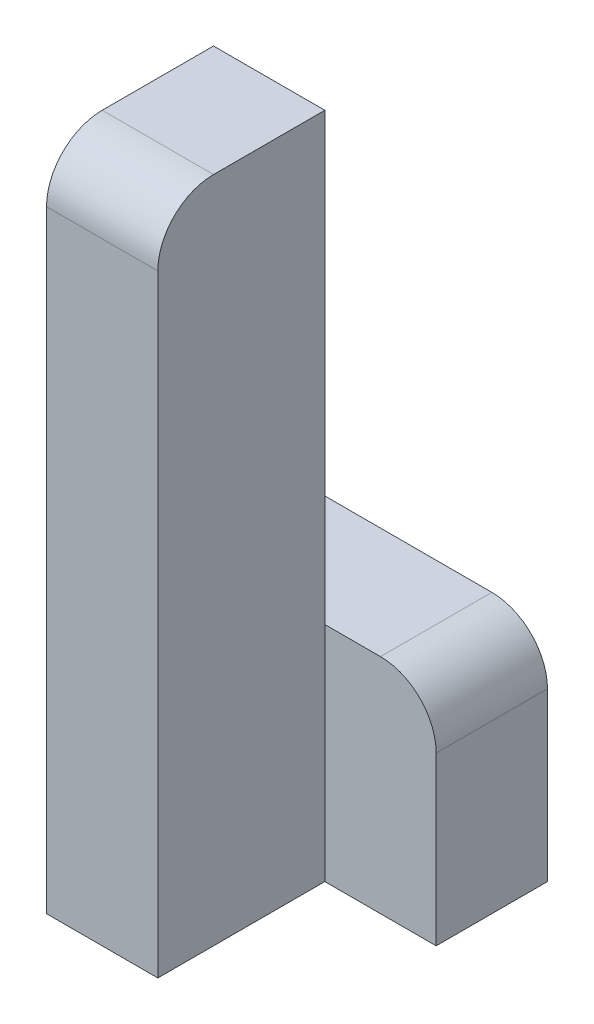
ISO-10303-21;
HEADER;
FILE_DESCRIPTION(('STEP AP214'),'2;1');
FILE_NAME('part.step','',(''),(''),'','','');
FILE_SCHEMA(('AUTOMOTIVE_DESIGN { 1 0 10303 214 1 1 1 1 }'));
ENDSEC;
DATA;
#1=APPLICATION_CONTEXT('core data for automotive mechanical design processes');
#2=APPLICATION_PROTOCOL_DEFINITION('international standard','automotive_design',2000,#1);
#3=PRODUCT_CONTEXT('',#1,'mechanical');
#4=PRODUCT('Part','Part','',(#3));
#5=PRODUCT_RELATED_PRODUCT_CATEGORY('part','',(#4));
#6=PRODUCT_DEFINITION_FORMATION('','',#4);
#7=PRODUCT_DEFINITION_CONTEXT('part definition',#1,'design');
#8=PRODUCT_DEFINITION('design','',#6,#7);
#9=PRODUCT_DEFINITION_SHAPE('','',#8);
#10=(LENGTH_UNIT() NAMED_UNIT(*) SI_UNIT(.MILLI.,.METRE.));
#11=(NAMED_UNIT(*) PLANE_ANGLE_UNIT() SI_UNIT($,.RADIAN.));
#12=(NAMED_UNIT(*) SI_UNIT($,.STERADIAN.) SOLID_ANGLE_UNIT());
#13=UNCERTAINTY_MEASURE_WITH_UNIT(LENGTH_MEASURE(1.E-05),#10,'distance_accuracy_value','');
#14=(GEOMETRIC_REPRESENTATION_CONTEXT(3) GLOBAL_UNCERTAINTY_ASSIGNED_CONTEXT((#13)) GLOBAL_UNIT_ASSIGNED_CONTEXT((#10,
#11,#12)) REPRESENTATION_CONTEXT('',''));
#15=CARTESIAN_POINT('',(0.,0.,0.));
#16=DIRECTION('',(0.,0.,1.));
#17=DIRECTION('',(1.,0.,0.));
#18=AXIS2_PLACEMENT_3D('',#15,#16,#17);
#19=CARTESIAN_POINT('',(-10.,0.,30.));
#20=DIRECTION('',(0.,-1.,0.));
#21=DIRECTION('',(1.,0.,0.));
#22=AXIS2_PLACEMENT_3D('',#19,#20,#21);
#23=PLANE('',#22);
#24=DIRECTION('',(0.,0.,-1.));
#25=VECTOR('',#24,1.);
#26=CARTESIAN_POINT('',(-30.,0.,30.));
#27=LINE('',#26,#25);
#28=CARTESIAN_POINT('',(-30.,0.,20.));
#29=VERTEX_POINT('',#28);
#30=CARTESIAN_POINT('',(-30.,0.,0.));
#31=VERTEX_POINT('',#30);
#32=EDGE_CURVE('E171',#29,#31,#27,.T.);
#33=ORIENTED_EDGE('',*,*,#32,.F.);
#34=DIRECTION('',(-1.,0.,0.));
#35=VECTOR('',#34,1.);
#36=CARTESIAN_POINT('',(-10.,0.,20.));
#37=LINE('',#36,#35);
#38=CARTESIAN_POINT('',(-10.,0.,20.));
#39=VERTEX_POINT('',#38);
#40=EDGE_CURVE('E43',#29,#39,#37,.F.);
#41=ORIENTED_EDGE('',*,*,#40,.T.);
#42=DIRECTION('',(0.,0.,-1.));
#43=VECTOR('',#42,1.);
#44=CARTESIAN_POINT('',(-10.,0.,30.));
#45=LINE('',#44,#43);
#46=CARTESIAN_POINT('',(-10.,0.,0.));
#47=VERTEX_POINT('',#46);
#48=EDGE_CURVE('E158',#39,#47,#45,.T.);
#49=ORIENTED_EDGE('',*,*,#48,.T.);
#50=DIRECTION('',(-1.,0.,0.));
#51=VECTOR('',#50,1.);
#52=CARTESIAN_POINT('',(-10.,0.,0.));
#53=LINE('',#52,#51);
#54=EDGE_CURVE('E148',#47,#31,#53,.T.);
#55=ORIENTED_EDGE('',*,*,#54,.T.);
#56=EDGE_LOOP('',(#33,#41,#49,#55));
#57=FACE_BOUND('',#56,.T.);
#58=ADVANCED_FACE('F35',(#57),#23,.F.);
#59=CARTESIAN_POINT('',(-30.,0.,30.));
#60=DIRECTION('',(1.,0.,0.));
#61=DIRECTION('',(0.,0.,-1.));
#62=AXIS2_PLACEMENT_3D('',#59,#60,#61);
#63=PLANE('',#62);
#64=DIRECTION('',(0.,-1.,0.));
#65=VECTOR('',#64,1.);
#66=CARTESIAN_POINT('',(-30.,0.,30.));
#67=LINE('',#66,#65);
#68=CARTESIAN_POINT('',(-30.,-10.,30.));
#69=VERTEX_POINT('',#68);
#70=CARTESIAN_POINT('',(-30.,-120.,30.));
#71=VERTEX_POINT('',#70);
#72=EDGE_CURVE('E150',#69,#71,#67,.T.);
#73=ORIENTED_EDGE('',*,*,#72,.F.);
#74=CARTESIAN_POINT('',(-30.,-10.,20.));
#75=DIRECTION('',(1.,0.,0.));
#76=DIRECTION('',(0.,0.,-1.));
#77=AXIS2_PLACEMENT_3D('',#74,#75,#76);
#78=CIRCLE('',#77,10.);
#79=EDGE_CURVE('E57',#69,#29,#78,.F.);
#80=ORIENTED_EDGE('',*,*,#79,.T.);
#81=ORIENTED_EDGE('',*,*,#32,.T.);
#82=DIRECTION('',(0.,-1.,0.));
#83=VECTOR('',#82,1.);
#84=CARTESIAN_POINT('',(-30.,0.,0.));
#85=LINE('',#84,#83);
#86=CARTESIAN_POINT('',(-30.,-80.,0.));
#87=VERTEX_POINT('',#86);
#88=EDGE_CURVE('E126',#31,#87,#85,.T.);
#89=ORIENTED_EDGE('',*,*,#88,.T.);
#90=DIRECTION('',(0.,0.,1.));
#91=VECTOR('',#90,1.);
#92=CARTESIAN_POINT('',(-30.,-80.,-20.));
#93=LINE('',#92,#91);
#94=CARTESIAN_POINT('',(-30.,-80.,-20.));
#95=VERTEX_POINT('',#94);
#96=EDGE_CURVE('E111',#95,#87,#93,.T.);
#97=ORIENTED_EDGE('',*,*,#96,.F.);
#98=DIRECTION('',(0.,-1.,0.));
#99=VECTOR('',#98,1.);
#100=CARTESIAN_POINT('',(-30.,-80.,-20.));
#101=LINE('',#100,#99);
#102=CARTESIAN_POINT('',(-30.,-120.,-20.));
#103=VERTEX_POINT('',#102);
#104=EDGE_CURVE('E118',#95,#103,#101,.T.);
#105=ORIENTED_EDGE('',*,*,#104,.T.);
#106=DIRECTION('',(0.,0.,-1.));
#107=VECTOR('',#106,1.);
#108=CARTESIAN_POINT('',(-30.,-120.,30.));
#109=LINE('',#108,#107);
#110=EDGE_CURVE('E169',#71,#103,#109,.T.);
#111=ORIENTED_EDGE('',*,*,#110,.F.);
#112=EDGE_LOOP('',(#73,#80,#81,#89,#97,#105,#111));
#113=FACE_BOUND('',#112,.T.);
#114=ADVANCED_FACE('F123',(#113),#63,.F.);
#115=CARTESIAN_POINT('',(-30.,-120.,30.));
#116=DIRECTION('',(0.,1.,0.));
#117=DIRECTION('',(0.,0.,1.));
#118=AXIS2_PLACEMENT_3D('',#115,#116,#117);
#119=PLANE('',#118);
#120=ORIENTED_EDGE('',*,*,#110,.T.);
#121=DIRECTION('',(1.,0.,0.));
#122=VECTOR('',#121,1.);
#123=CARTESIAN_POINT('',(-30.,-120.,-20.));
#124=LINE('',#123,#122);
#125=CARTESIAN_POINT('',(10.,-120.,-20.));
#126=VERTEX_POINT('',#125);
#127=EDGE_CURVE('E134',#103,#126,#124,.T.);
#128=ORIENTED_EDGE('',*,*,#127,.T.);
#129=DIRECTION('',(0.,0.,1.));
#130=VECTOR('',#129,1.);
#131=CARTESIAN_POINT('',(10.,-120.,-20.));
#132=LINE('',#131,#130);
#133=CARTESIAN_POINT('',(10.,-120.,0.));
#134=VERTEX_POINT('',#133);
#135=EDGE_CURVE('E127',#126,#134,#132,.T.);
#136=ORIENTED_EDGE('',*,*,#135,.T.);
#137=DIRECTION('',(1.,0.,0.));
#138=VECTOR('',#137,1.);
#139=CARTESIAN_POINT('',(-30.,-120.,0.));
#140=LINE('',#139,#138);
#141=CARTESIAN_POINT('',(-10.,-120.,0.));
#142=VERTEX_POINT('',#141);
#143=EDGE_CURVE('E142',#142,#134,#140,.T.);
#144=ORIENTED_EDGE('',*,*,#143,.F.);
#145=DIRECTION('',(0.,0.,-1.));
#146=VECTOR('',#145,1.);
#147=CARTESIAN_POINT('',(-10.,-120.,30.));
#148=LINE('',#147,#146);
#149=CARTESIAN_POINT('',(-10.,-120.,30.));
#150=VERTEX_POINT('',#149);
#151=EDGE_CURVE('E166',#150,#142,#148,.T.);
#152=ORIENTED_EDGE('',*,*,#151,.F.);
#153=DIRECTION('',(1.,0.,0.));
#154=VECTOR('',#153,1.);
#155=CARTESIAN_POINT('',(-30.,-120.,30.));
#156=LINE('',#155,#154);
#157=EDGE_CURVE('E152',#71,#150,#156,.T.);
#158=ORIENTED_EDGE('',*,*,#157,.F.);
#159=EDGE_LOOP('',(#120,#128,#136,#144,#152,#158));
#160=FACE_BOUND('',#159,.T.);
#161=ADVANCED_FACE('F193',(#160),#119,.F.);
#162=CARTESIAN_POINT('',(-10.,-120.,30.));
#163=DIRECTION('',(-1.,0.,0.));
#164=DIRECTION('',(0.,0.,1.));
#165=AXIS2_PLACEMENT_3D('',#162,#163,#164);
#166=PLANE('',#165);
#167=ORIENTED_EDGE('',*,*,#48,.F.);
#168=CARTESIAN_POINT('',(-10.,-10.,20.));
#169=DIRECTION('',(-1.,0.,0.));
#170=DIRECTION('',(0.,0.,1.));
#171=AXIS2_PLACEMENT_3D('',#168,#169,#170);
#172=CIRCLE('',#171,10.);
#173=CARTESIAN_POINT('',(-10.,-9.99999999999999,30.));
#174=VERTEX_POINT('',#173);
#175=EDGE_CURVE('E11',#39,#174,#172,.F.);
#176=ORIENTED_EDGE('',*,*,#175,.T.);
#177=DIRECTION('',(0.,1.,0.));
#178=VECTOR('',#177,1.);
#179=CARTESIAN_POINT('',(-10.,-120.,30.));
#180=LINE('',#179,#178);
#181=EDGE_CURVE('E155',#150,#174,#180,.T.);
#182=ORIENTED_EDGE('',*,*,#181,.F.);
#183=ORIENTED_EDGE('',*,*,#151,.T.);
#184=DIRECTION('',(0.,1.,0.));
#185=VECTOR('',#184,1.);
#186=CARTESIAN_POINT('',(-10.,-120.,0.));
#187=LINE('',#186,#185);
#188=CARTESIAN_POINT('',(-10.,-80.,0.));
#189=VERTEX_POINT('',#188);
#190=EDGE_CURVE('E153',#142,#189,#187,.T.);
#191=ORIENTED_EDGE('',*,*,#190,.T.);
#192=EDGE_CURVE('E162',#189,#47,#187,.T.);
#193=ORIENTED_EDGE('',*,*,#192,.T.);
#194=EDGE_LOOP('',(#167,#176,#182,#183,#191,#193));
#195=FACE_BOUND('',#194,.T.);
#196=ADVANCED_FACE('F196',(#195),#166,.F.);
#197=CARTESIAN_POINT('',(0.,0.,30.));
#198=DIRECTION('',(0.,0.,1.));
#199=DIRECTION('',(1.,0.,0.));
#200=AXIS2_PLACEMENT_3D('',#197,#198,#199);
#201=PLANE('',#200);
#202=ORIENTED_EDGE('',*,*,#181,.T.);
#203=DIRECTION('',(-1.,0.,0.));
#204=VECTOR('',#203,1.);
#205=CARTESIAN_POINT('',(-30.,-10.,30.));
#206=LINE('',#205,#204);
#207=EDGE_CURVE('E181',#174,#69,#206,.T.);
#208=ORIENTED_EDGE('',*,*,#207,.T.);
#209=ORIENTED_EDGE('',*,*,#72,.T.);
#210=ORIENTED_EDGE('',*,*,#157,.T.);
#211=EDGE_LOOP('',(#202,#208,#209,#210));
#212=FACE_BOUND('',#211,.T.);
#213=ADVANCED_FACE('F186',(#212),#201,.T.);
#214=CARTESIAN_POINT('',(0.,0.,0.));
#215=DIRECTION('',(0.,0.,1.));
#216=DIRECTION('',(1.,0.,0.));
#217=AXIS2_PLACEMENT_3D('',#214,#215,#216);
#218=PLANE('',#217);
#219=ORIENTED_EDGE('',*,*,#192,.F.);
#220=DIRECTION('',(-1.,0.,0.));
#221=VECTOR('',#220,1.);
#222=CARTESIAN_POINT('',(10.,-80.,0.));
#223=LINE('',#222,#221);
#224=EDGE_CURVE('E143',#189,#87,#223,.T.);
#225=ORIENTED_EDGE('',*,*,#224,.T.);
#226=ORIENTED_EDGE('',*,*,#88,.F.);
#227=ORIENTED_EDGE('',*,*,#54,.F.);
#228=EDGE_LOOP('',(#219,#225,#226,#227));
#229=FACE_BOUND('',#228,.T.);
#230=ADVANCED_FACE('F215',(#229),#218,.F.);
#231=CARTESIAN_POINT('',(0.,0.,0.));
#232=DIRECTION('',(0.,0.,1.));
#233=DIRECTION('',(1.,0.,0.));
#234=AXIS2_PLACEMENT_3D('',#231,#232,#233);
#235=PLANE('',#234);
#236=DIRECTION('',(0.,1.,0.));
#237=VECTOR('',#236,1.);
#238=CARTESIAN_POINT('',(10.,-120.,0.));
#239=LINE('',#238,#237);
#240=CARTESIAN_POINT('',(10.,-90.,0.));
#241=VERTEX_POINT('',#240);
#242=EDGE_CURVE('E119',#134,#241,#239,.T.);
#243=ORIENTED_EDGE('',*,*,#242,.T.);
#244=CARTESIAN_POINT('',(0.,-90.,0.));
#245=DIRECTION('',(0.,0.,1.));
#246=DIRECTION('',(1.,0.,0.));
#247=AXIS2_PLACEMENT_3D('',#244,#245,#246);
#248=CIRCLE('',#247,10.);
#249=CARTESIAN_POINT('',(0.,-80.,0.));
#250=VERTEX_POINT('',#249);
#251=EDGE_CURVE('E176',#241,#250,#248,.T.);
#252=ORIENTED_EDGE('',*,*,#251,.T.);
#253=EDGE_CURVE('E140',#250,#189,#223,.T.);
#254=ORIENTED_EDGE('',*,*,#253,.T.);
#255=ORIENTED_EDGE('',*,*,#190,.F.);
#256=ORIENTED_EDGE('',*,*,#143,.T.);
#257=EDGE_LOOP('',(#243,#252,#254,#255,#256));
#258=FACE_BOUND('',#257,.T.);
#259=ADVANCED_FACE('F218',(#258),#235,.T.);
#260=CARTESIAN_POINT('',(10.,-80.,-20.));
#261=DIRECTION('',(0.,1.,0.));
#262=DIRECTION('',(0.,0.,1.));
#263=AXIS2_PLACEMENT_3D('',#260,#261,#262);
#264=PLANE('',#263);
#265=ORIENTED_EDGE('',*,*,#253,.F.);
#266=DIRECTION('',(0.,0.,1.));
#267=VECTOR('',#266,1.);
#268=CARTESIAN_POINT('',(0.,-80.,-20.));
#269=LINE('',#268,#267);
#270=CARTESIAN_POINT('',(0.,-80.,-20.));
#271=VERTEX_POINT('',#270);
#272=EDGE_CURVE('E114',#250,#271,#269,.F.);
#273=ORIENTED_EDGE('',*,*,#272,.T.);
#274=DIRECTION('',(-1.,0.,0.));
#275=VECTOR('',#274,1.);
#276=CARTESIAN_POINT('',(10.,-80.,-20.));
#277=LINE('',#276,#275);
#278=EDGE_CURVE('E106',#271,#95,#277,.T.);
#279=ORIENTED_EDGE('',*,*,#278,.T.);
#280=ORIENTED_EDGE('',*,*,#96,.T.);
#281=ORIENTED_EDGE('',*,*,#224,.F.);
#282=EDGE_LOOP('',(#265,#273,#279,#280,#281));
#283=FACE_BOUND('',#282,.T.);
#284=ADVANCED_FACE('F109',(#283),#264,.T.);
#285=CARTESIAN_POINT('',(10.,-120.,-20.));
#286=DIRECTION('',(1.,0.,0.));
#287=DIRECTION('',(0.,0.,-1.));
#288=AXIS2_PLACEMENT_3D('',#285,#286,#287);
#289=PLANE('',#288);
#290=DIRECTION('',(0.,1.,0.));
#291=VECTOR('',#290,1.);
#292=CARTESIAN_POINT('',(10.,-120.,-20.));
#293=LINE('',#292,#291);
#294=CARTESIAN_POINT('',(10.,-90.,-20.));
#295=VERTEX_POINT('',#294);
#296=EDGE_CURVE('E128',#126,#295,#293,.T.);
#297=ORIENTED_EDGE('',*,*,#296,.T.);
#298=DIRECTION('',(0.,0.,1.));
#299=VECTOR('',#298,1.);
#300=CARTESIAN_POINT('',(10.,-90.,-20.));
#301=LINE('',#300,#299);
#302=EDGE_CURVE('E173',#295,#241,#301,.T.);
#303=ORIENTED_EDGE('',*,*,#302,.T.);
#304=ORIENTED_EDGE('',*,*,#242,.F.);
#305=ORIENTED_EDGE('',*,*,#135,.F.);
#306=EDGE_LOOP('',(#297,#303,#304,#305));
#307=FACE_BOUND('',#306,.T.);
#308=ADVANCED_FACE('F224',(#307),#289,.T.);
#309=CARTESIAN_POINT('',(0.,0.,-20.));
#310=DIRECTION('',(0.,0.,1.));
#311=DIRECTION('',(1.,0.,0.));
#312=AXIS2_PLACEMENT_3D('',#309,#310,#311);
#313=PLANE('',#312);
#314=ORIENTED_EDGE('',*,*,#278,.F.);
#315=CARTESIAN_POINT('',(0.,-90.,-20.));
#316=DIRECTION('',(0.,0.,1.));
#317=DIRECTION('',(1.,0.,0.));
#318=AXIS2_PLACEMENT_3D('',#315,#316,#317);
#319=CIRCLE('',#318,10.);
#320=EDGE_CURVE('E179',#271,#295,#319,.F.);
#321=ORIENTED_EDGE('',*,*,#320,.T.);
#322=ORIENTED_EDGE('',*,*,#296,.F.);
#323=ORIENTED_EDGE('',*,*,#127,.F.);
#324=ORIENTED_EDGE('',*,*,#104,.F.);
#325=EDGE_LOOP('',(#314,#321,#322,#323,#324));
#326=FACE_BOUND('',#325,.T.);
#327=ADVANCED_FACE('F131',(#326),#313,.F.);
#328=CARTESIAN_POINT('',(0.,-90.,-20.));
#329=DIRECTION('',(0.,0.,1.));
#330=DIRECTION('',(1.,0.,0.));
#331=AXIS2_PLACEMENT_3D('',#328,#329,#330);
#332=CYLINDRICAL_SURFACE('',#331,10.);
#333=ORIENTED_EDGE('',*,*,#320,.F.);
#334=ORIENTED_EDGE('',*,*,#272,.F.);
#335=ORIENTED_EDGE('',*,*,#251,.F.);
#336=ORIENTED_EDGE('',*,*,#302,.F.);
#337=EDGE_LOOP('',(#333,#334,#335,#336));
#338=FACE_BOUND('',#337,.T.);
#339=ADVANCED_FACE('F199',(#338),#332,.T.);
#340=CARTESIAN_POINT('',(0.,-10.,20.));
#341=DIRECTION('',(1.,0.,0.));
#342=DIRECTION('',(0.,1.,0.));
#343=AXIS2_PLACEMENT_3D('',#340,#341,#342);
#344=CYLINDRICAL_SURFACE('',#343,10.);
#345=ORIENTED_EDGE('',*,*,#175,.F.);
#346=ORIENTED_EDGE('',*,*,#40,.F.);
#347=ORIENTED_EDGE('',*,*,#79,.F.);
#348=ORIENTED_EDGE('',*,*,#207,.F.);
#349=EDGE_LOOP('',(#345,#346,#347,#348));
#350=FACE_BOUND('',#349,.T.);
#351=ADVANCED_FACE('F37',(#350),#344,.T.);
#352=CLOSED_SHELL('',(#58,#114,#161,#196,#213,#230,#259,#284,#308,#327,#339,#351));
#353=MANIFOLD_SOLID_BREP('B2',#352);
#354=ADVANCED_BREP_SHAPE_REPRESENTATION('',(#18,#353),#14);
#355=SHAPE_DEFINITION_REPRESENTATION(#9,#354);
ENDSEC;
END-ISO-10303-21;
